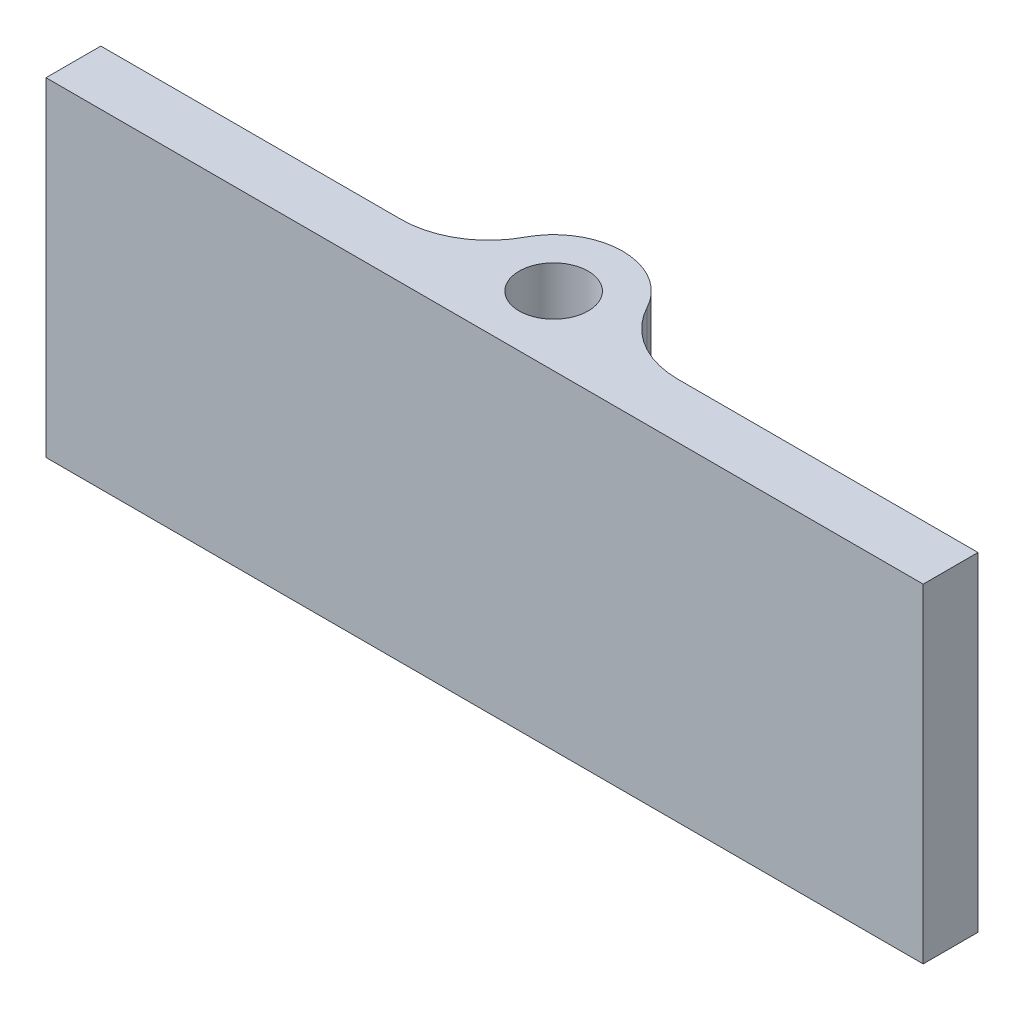
ISO-10303-21;
HEADER;
FILE_DESCRIPTION(('STEP AP214'),'2;1');
FILE_NAME('part.step','',(''),(''),'','','');
FILE_SCHEMA(('AUTOMOTIVE_DESIGN { 1 0 10303 214 1 1 1 1 }'));
ENDSEC;
DATA;
#1=APPLICATION_CONTEXT('core data for automotive mechanical design processes');
#2=APPLICATION_PROTOCOL_DEFINITION('international standard','automotive_design',2000,#1);
#3=PRODUCT_CONTEXT('',#1,'mechanical');
#4=PRODUCT('Part','Part','',(#3));
#5=PRODUCT_RELATED_PRODUCT_CATEGORY('part','',(#4));
#6=PRODUCT_DEFINITION_FORMATION('','',#4);
#7=PRODUCT_DEFINITION_CONTEXT('part definition',#1,'design');
#8=PRODUCT_DEFINITION('design','',#6,#7);
#9=PRODUCT_DEFINITION_SHAPE('','',#8);
#10=(LENGTH_UNIT() NAMED_UNIT(*) SI_UNIT(.MILLI.,.METRE.));
#11=(NAMED_UNIT(*) PLANE_ANGLE_UNIT() SI_UNIT($,.RADIAN.));
#12=(NAMED_UNIT(*) SI_UNIT($,.STERADIAN.) SOLID_ANGLE_UNIT());
#13=UNCERTAINTY_MEASURE_WITH_UNIT(LENGTH_MEASURE(1.E-05),#10,'distance_accuracy_value','');
#14=(GEOMETRIC_REPRESENTATION_CONTEXT(3) GLOBAL_UNCERTAINTY_ASSIGNED_CONTEXT((#13)) GLOBAL_UNIT_ASSIGNED_CONTEXT((#10,
#11,#12)) REPRESENTATION_CONTEXT('',''));
#15=CARTESIAN_POINT('',(0.,0.,0.));
#16=DIRECTION('',(0.,0.,1.));
#17=DIRECTION('',(1.,0.,0.));
#18=AXIS2_PLACEMENT_3D('',#15,#16,#17);
#19=CARTESIAN_POINT('',(0.,9.525,2.));
#20=DIRECTION('',(0.,0.,-1.));
#21=DIRECTION('',(-1.,0.,0.));
#22=AXIS2_PLACEMENT_3D('',#19,#20,#21);
#23=PLANE('',#22);
#24=DIRECTION('',(1.,0.,0.));
#25=VECTOR('',#24,1.);
#26=CARTESIAN_POINT('',(0.,0.,2.));
#27=LINE('',#26,#25);
#28=CARTESIAN_POINT('',(-12.7,0.,2.));
#29=VERTEX_POINT('',#28);
#30=CARTESIAN_POINT('',(12.7,0.,2.));
#31=VERTEX_POINT('',#30);
#32=EDGE_CURVE('E137',#29,#31,#27,.T.);
#33=ORIENTED_EDGE('',*,*,#32,.T.);
#34=DIRECTION('',(0.,-1.,0.));
#35=VECTOR('',#34,1.);
#36=CARTESIAN_POINT('',(12.7,9.525,2.));
#37=LINE('',#36,#35);
#38=CARTESIAN_POINT('',(12.7,9.525,2.));
#39=VERTEX_POINT('',#38);
#40=EDGE_CURVE('E117',#39,#31,#37,.T.);
#41=ORIENTED_EDGE('',*,*,#40,.F.);
#42=DIRECTION('',(1.,0.,0.));
#43=VECTOR('',#42,1.);
#44=CARTESIAN_POINT('',(0.,9.525,2.));
#45=LINE('',#44,#43);
#46=CARTESIAN_POINT('',(-12.7,9.525,2.));
#47=VERTEX_POINT('',#46);
#48=EDGE_CURVE('E124',#47,#39,#45,.T.);
#49=ORIENTED_EDGE('',*,*,#48,.F.);
#50=DIRECTION('',(0.,-1.,0.));
#51=VECTOR('',#50,1.);
#52=CARTESIAN_POINT('',(-12.7,9.525,2.));
#53=LINE('',#52,#51);
#54=EDGE_CURVE('E201',#47,#29,#53,.T.);
#55=ORIENTED_EDGE('',*,*,#54,.T.);
#56=EDGE_LOOP('',(#33,#41,#49,#55));
#57=FACE_BOUND('',#56,.T.);
#58=ADVANCED_FACE('F47',(#57),#23,.F.);
#59=CARTESIAN_POINT('',(12.7,9.525,0.));
#60=DIRECTION('',(-1.,0.,0.));
#61=DIRECTION('',(0.,0.,1.));
#62=AXIS2_PLACEMENT_3D('',#59,#60,#61);
#63=PLANE('',#62);
#64=DIRECTION('',(0.,0.,-1.));
#65=VECTOR('',#64,1.);
#66=CARTESIAN_POINT('',(12.7,0.,0.));
#67=LINE('',#66,#65);
#68=CARTESIAN_POINT('',(12.7,0.,0.4125));
#69=VERTEX_POINT('',#68);
#70=EDGE_CURVE('E195',#31,#69,#67,.T.);
#71=ORIENTED_EDGE('',*,*,#70,.T.);
#72=DIRECTION('',(0.,-1.,0.));
#73=VECTOR('',#72,1.);
#74=CARTESIAN_POINT('',(12.7,9.525,0.4125));
#75=LINE('',#74,#73);
#76=CARTESIAN_POINT('',(12.7,9.525,0.4125));
#77=VERTEX_POINT('',#76);
#78=EDGE_CURVE('E120',#77,#69,#75,.T.);
#79=ORIENTED_EDGE('',*,*,#78,.F.);
#80=DIRECTION('',(0.,0.,-1.));
#81=VECTOR('',#80,1.);
#82=CARTESIAN_POINT('',(12.7,9.525,0.));
#83=LINE('',#82,#81);
#84=EDGE_CURVE('E113',#39,#77,#83,.T.);
#85=ORIENTED_EDGE('',*,*,#84,.F.);
#86=ORIENTED_EDGE('',*,*,#40,.T.);
#87=EDGE_LOOP('',(#71,#79,#85,#86));
#88=FACE_BOUND('',#87,.T.);
#89=ADVANCED_FACE('F115',(#88),#63,.F.);
#90=CARTESIAN_POINT('',(0.,9.525,0.4125));
#91=DIRECTION('',(0.,0.,1.));
#92=DIRECTION('',(1.,0.,0.));
#93=AXIS2_PLACEMENT_3D('',#90,#91,#92);
#94=PLANE('',#93);
#95=DIRECTION('',(-1.,0.,0.));
#96=VECTOR('',#95,1.);
#97=CARTESIAN_POINT('',(0.,0.,0.4125));
#98=LINE('',#97,#96);
#99=CARTESIAN_POINT('',(4.01065378086915,0.,0.4125));
#100=VERTEX_POINT('',#99);
#101=EDGE_CURVE('E189',#69,#100,#98,.T.);
#102=ORIENTED_EDGE('',*,*,#101,.T.);
#103=DIRECTION('',(0.,1.,0.));
#104=VECTOR('',#103,1.);
#105=CARTESIAN_POINT('',(4.01065378086915,9.525,0.4125));
#106=LINE('',#105,#104);
#107=CARTESIAN_POINT('',(4.01065378086915,9.525,0.4125));
#108=VERTEX_POINT('',#107);
#109=EDGE_CURVE('E63',#100,#108,#106,.T.);
#110=ORIENTED_EDGE('',*,*,#109,.T.);
#111=DIRECTION('',(-1.,0.,0.));
#112=VECTOR('',#111,1.);
#113=CARTESIAN_POINT('',(0.,9.525,0.4125));
#114=LINE('',#113,#112);
#115=EDGE_CURVE('E123',#77,#108,#114,.T.);
#116=ORIENTED_EDGE('',*,*,#115,.F.);
#117=ORIENTED_EDGE('',*,*,#78,.T.);
#118=EDGE_LOOP('',(#102,#110,#116,#117));
#119=FACE_BOUND('',#118,.T.);
#120=ADVANCED_FACE('F243',(#119),#94,.F.);
#121=CARTESIAN_POINT('',(0.,9.525,0.));
#122=DIRECTION('',(0.,-1.,0.));
#123=DIRECTION('',(0.,0.,-1.));
#124=AXIS2_PLACEMENT_3D('',#121,#122,#123);
#125=CYLINDRICAL_SURFACE('',#124,2.);
#126=CARTESIAN_POINT('',(0.,0.,0.));
#127=DIRECTION('',(0.,1.,0.));
#128=DIRECTION('',(0.,0.,1.));
#129=AXIS2_PLACEMENT_3D('',#126,#127,#128);
#130=CIRCLE('',#129,2.);
#131=CARTESIAN_POINT('',(1.766807832982,0.,-0.937224669603524));
#132=VERTEX_POINT('',#131);
#133=CARTESIAN_POINT('',(-1.766807832982,0.,-0.937224669603524));
#134=VERTEX_POINT('',#133);
#135=EDGE_CURVE('E182',#132,#134,#130,.T.);
#136=ORIENTED_EDGE('',*,*,#135,.T.);
#137=DIRECTION('',(0.,-1.,0.));
#138=VECTOR('',#137,1.);
#139=CARTESIAN_POINT('',(-1.766807832982,9.525,-0.937224669603524));
#140=LINE('',#139,#138);
#141=CARTESIAN_POINT('',(-1.766807832982,9.525,-0.937224669603524));
#142=VERTEX_POINT('',#141);
#143=EDGE_CURVE('E153',#134,#142,#140,.F.);
#144=ORIENTED_EDGE('',*,*,#143,.T.);
#145=CARTESIAN_POINT('',(0.,9.525,0.));
#146=DIRECTION('',(0.,1.,0.));
#147=DIRECTION('',(0.,0.,1.));
#148=AXIS2_PLACEMENT_3D('',#145,#146,#147);
#149=CIRCLE('',#148,2.);
#150=CARTESIAN_POINT('',(1.766807832982,9.525,-0.937224669603524));
#151=VERTEX_POINT('',#150);
#152=EDGE_CURVE('E169',#151,#142,#149,.T.);
#153=ORIENTED_EDGE('',*,*,#152,.F.);
#154=DIRECTION('',(0.,-1.,0.));
#155=VECTOR('',#154,1.);
#156=CARTESIAN_POINT('',(1.766807832982,9.525,-0.937224669603524));
#157=LINE('',#156,#155);
#158=EDGE_CURVE('E144',#151,#132,#157,.T.);
#159=ORIENTED_EDGE('',*,*,#158,.T.);
#160=EDGE_LOOP('',(#136,#144,#153,#159));
#161=FACE_BOUND('',#160,.T.);
#162=ADVANCED_FACE('F186',(#161),#125,.T.);
#163=CARTESIAN_POINT('',(0.,9.525,0.4125));
#164=DIRECTION('',(0.,0.,-1.));
#165=DIRECTION('',(-1.,0.,0.));
#166=AXIS2_PLACEMENT_3D('',#163,#164,#165);
#167=PLANE('',#166);
#168=DIRECTION('',(1.,0.,0.));
#169=VECTOR('',#168,1.);
#170=CARTESIAN_POINT('',(0.,9.525,0.4125));
#171=LINE('',#170,#169);
#172=CARTESIAN_POINT('',(-12.7,9.525,0.4125));
#173=VERTEX_POINT('',#172);
#174=CARTESIAN_POINT('',(-4.01065378086915,9.525,0.4125));
#175=VERTEX_POINT('',#174);
#176=EDGE_CURVE('E167',#173,#175,#171,.T.);
#177=ORIENTED_EDGE('',*,*,#176,.T.);
#178=DIRECTION('',(0.,-1.,0.));
#179=VECTOR('',#178,1.);
#180=CARTESIAN_POINT('',(-4.01065378086915,9.525,0.4125));
#181=LINE('',#180,#179);
#182=CARTESIAN_POINT('',(-4.01065378086915,0.,0.4125));
#183=VERTEX_POINT('',#182);
#184=EDGE_CURVE('E139',#175,#183,#181,.T.);
#185=ORIENTED_EDGE('',*,*,#184,.T.);
#186=DIRECTION('',(1.,0.,0.));
#187=VECTOR('',#186,1.);
#188=CARTESIAN_POINT('',(0.,0.,0.4125));
#189=LINE('',#188,#187);
#190=CARTESIAN_POINT('',(-12.7,0.,0.4125));
#191=VERTEX_POINT('',#190);
#192=EDGE_CURVE('E184',#191,#183,#189,.T.);
#193=ORIENTED_EDGE('',*,*,#192,.F.);
#194=DIRECTION('',(0.,-1.,0.));
#195=VECTOR('',#194,1.);
#196=CARTESIAN_POINT('',(-12.7,9.525,0.4125));
#197=LINE('',#196,#195);
#198=EDGE_CURVE('E146',#173,#191,#197,.T.);
#199=ORIENTED_EDGE('',*,*,#198,.F.);
#200=EDGE_LOOP('',(#177,#185,#193,#199));
#201=FACE_BOUND('',#200,.T.);
#202=ADVANCED_FACE('F174',(#201),#167,.T.);
#203=CARTESIAN_POINT('',(0.,9.525,0.));
#204=DIRECTION('',(0.,-1.,0.));
#205=DIRECTION('',(0.,0.,-1.));
#206=AXIS2_PLACEMENT_3D('',#203,#204,#205);
#207=CYLINDRICAL_SURFACE('',#206,1.);
#208=CARTESIAN_POINT('',(0.,9.525,0.));
#209=DIRECTION('',(0.,1.,0.));
#210=DIRECTION('',(0.,0.,1.));
#211=AXIS2_PLACEMENT_3D('',#208,#209,#210);
#212=CIRCLE('',#211,1.);
#213=CARTESIAN_POINT('',(0.,9.525,1.));
#214=VERTEX_POINT('',#213);
#215=EDGE_CURVE('E134',#214,#214,#212,.T.);
#216=ORIENTED_EDGE('',*,*,#215,.T.);
#217=EDGE_LOOP('',(#216));
#218=FACE_BOUND('',#217,.T.);
#219=CARTESIAN_POINT('',(0.,0.,0.));
#220=DIRECTION('',(0.,1.,0.));
#221=DIRECTION('',(0.,0.,1.));
#222=AXIS2_PLACEMENT_3D('',#219,#220,#221);
#223=CIRCLE('',#222,1.);
#224=CARTESIAN_POINT('',(0.,0.,1.));
#225=VERTEX_POINT('',#224);
#226=EDGE_CURVE('E208',#225,#225,#223,.T.);
#227=ORIENTED_EDGE('',*,*,#226,.F.);
#228=EDGE_LOOP('',(#227));
#229=FACE_BOUND('',#228,.T.);
#230=ADVANCED_FACE('F225',(#218,#229),#207,.F.);
#231=CARTESIAN_POINT('',(-12.7,9.525,0.));
#232=DIRECTION('',(-1.,0.,0.));
#233=DIRECTION('',(0.,0.,1.));
#234=AXIS2_PLACEMENT_3D('',#231,#232,#233);
#235=PLANE('',#234);
#236=DIRECTION('',(0.,0.,-1.));
#237=VECTOR('',#236,1.);
#238=CARTESIAN_POINT('',(-12.7,0.,0.));
#239=LINE('',#238,#237);
#240=EDGE_CURVE('E193',#29,#191,#239,.T.);
#241=ORIENTED_EDGE('',*,*,#240,.F.);
#242=ORIENTED_EDGE('',*,*,#54,.F.);
#243=DIRECTION('',(0.,0.,-1.));
#244=VECTOR('',#243,1.);
#245=CARTESIAN_POINT('',(-12.7,9.525,0.));
#246=LINE('',#245,#244);
#247=EDGE_CURVE('E131',#47,#173,#246,.T.);
#248=ORIENTED_EDGE('',*,*,#247,.T.);
#249=ORIENTED_EDGE('',*,*,#198,.T.);
#250=EDGE_LOOP('',(#241,#242,#248,#249));
#251=FACE_BOUND('',#250,.T.);
#252=ADVANCED_FACE('F206',(#251),#235,.T.);
#253=CARTESIAN_POINT('',(0.,9.525,0.));
#254=DIRECTION('',(0.,1.,0.));
#255=DIRECTION('',(0.,0.,1.));
#256=AXIS2_PLACEMENT_3D('',#253,#254,#255);
#257=PLANE('',#256);
#258=ORIENTED_EDGE('',*,*,#215,.F.);
#259=EDGE_LOOP('',(#258));
#260=FACE_BOUND('',#259,.T.);
#261=ORIENTED_EDGE('',*,*,#48,.T.);
#262=ORIENTED_EDGE('',*,*,#84,.T.);
#263=ORIENTED_EDGE('',*,*,#115,.T.);
#264=CARTESIAN_POINT('',(4.01065378086915,9.525,-2.1275));
#265=DIRECTION('',(0.,1.,0.));
#266=DIRECTION('',(0.,0.,1.));
#267=AXIS2_PLACEMENT_3D('',#264,#265,#266);
#268=CIRCLE('',#267,2.54);
#269=EDGE_CURVE('E11',#108,#151,#268,.F.);
#270=ORIENTED_EDGE('',*,*,#269,.T.);
#271=ORIENTED_EDGE('',*,*,#152,.T.);
#272=CARTESIAN_POINT('',(-4.01065378086915,9.525,-2.1275));
#273=DIRECTION('',(0.,1.,0.));
#274=DIRECTION('',(0.,0.,1.));
#275=AXIS2_PLACEMENT_3D('',#272,#273,#274);
#276=CIRCLE('',#275,2.54);
#277=EDGE_CURVE('E161',#142,#175,#276,.F.);
#278=ORIENTED_EDGE('',*,*,#277,.T.);
#279=ORIENTED_EDGE('',*,*,#176,.F.);
#280=ORIENTED_EDGE('',*,*,#247,.F.);
#281=EDGE_LOOP('',(#261,#262,#263,#270,#271,#278,#279,#280));
#282=FACE_BOUND('',#281,.T.);
#283=ADVANCED_FACE('F128',(#260,#282),#257,.T.);
#284=CARTESIAN_POINT('',(0.,0.,0.));
#285=DIRECTION('',(0.,1.,0.));
#286=DIRECTION('',(0.,0.,1.));
#287=AXIS2_PLACEMENT_3D('',#284,#285,#286);
#288=PLANE('',#287);
#289=ORIENTED_EDGE('',*,*,#226,.T.);
#290=EDGE_LOOP('',(#289));
#291=FACE_BOUND('',#290,.T.);
#292=ORIENTED_EDGE('',*,*,#32,.F.);
#293=ORIENTED_EDGE('',*,*,#240,.T.);
#294=ORIENTED_EDGE('',*,*,#192,.T.);
#295=CARTESIAN_POINT('',(-4.01065378086915,0.,-2.1275));
#296=DIRECTION('',(0.,1.,0.));
#297=DIRECTION('',(0.,0.,1.));
#298=AXIS2_PLACEMENT_3D('',#295,#296,#297);
#299=CIRCLE('',#298,2.54);
#300=EDGE_CURVE('E158',#183,#134,#299,.T.);
#301=ORIENTED_EDGE('',*,*,#300,.T.);
#302=ORIENTED_EDGE('',*,*,#135,.F.);
#303=CARTESIAN_POINT('',(4.01065378086915,0.,-2.1275));
#304=DIRECTION('',(0.,1.,0.));
#305=DIRECTION('',(0.,0.,1.));
#306=AXIS2_PLACEMENT_3D('',#303,#304,#305);
#307=CIRCLE('',#306,2.54);
#308=EDGE_CURVE('E56',#132,#100,#307,.T.);
#309=ORIENTED_EDGE('',*,*,#308,.T.);
#310=ORIENTED_EDGE('',*,*,#101,.F.);
#311=ORIENTED_EDGE('',*,*,#70,.F.);
#312=EDGE_LOOP('',(#292,#293,#294,#301,#302,#309,#310,#311));
#313=FACE_BOUND('',#312,.T.);
#314=ADVANCED_FACE('F181',(#291,#313),#288,.F.);
#315=CARTESIAN_POINT('',(-4.01065378086915,9.525,-2.1275));
#316=DIRECTION('',(0.,-1.,0.));
#317=DIRECTION('',(0.,0.,-1.));
#318=AXIS2_PLACEMENT_3D('',#315,#316,#317);
#319=CYLINDRICAL_SURFACE('',#318,2.54);
#320=ORIENTED_EDGE('',*,*,#277,.F.);
#321=ORIENTED_EDGE('',*,*,#143,.F.);
#322=ORIENTED_EDGE('',*,*,#300,.F.);
#323=ORIENTED_EDGE('',*,*,#184,.F.);
#324=EDGE_LOOP('',(#320,#321,#322,#323));
#325=FACE_BOUND('',#324,.T.);
#326=ADVANCED_FACE('F179',(#325),#319,.F.);
#327=CARTESIAN_POINT('',(4.01065378086915,9.525,-2.1275));
#328=DIRECTION('',(0.,-1.,0.));
#329=DIRECTION('',(0.,0.,-1.));
#330=AXIS2_PLACEMENT_3D('',#327,#328,#329);
#331=CYLINDRICAL_SURFACE('',#330,2.54);
#332=ORIENTED_EDGE('',*,*,#269,.F.);
#333=ORIENTED_EDGE('',*,*,#109,.F.);
#334=ORIENTED_EDGE('',*,*,#308,.F.);
#335=ORIENTED_EDGE('',*,*,#158,.F.);
#336=EDGE_LOOP('',(#332,#333,#334,#335));
#337=FACE_BOUND('',#336,.T.);
#338=ADVANCED_FACE('F49',(#337),#331,.F.);
#339=CLOSED_SHELL('',(#58,#89,#120,#162,#202,#230,#252,#283,#314,#326,#338));
#340=MANIFOLD_SOLID_BREP('B2',#339);
#341=ADVANCED_BREP_SHAPE_REPRESENTATION('',(#18,#340),#14);
#342=SHAPE_DEFINITION_REPRESENTATION(#9,#341);
ENDSEC;
END-ISO-10303-21;
